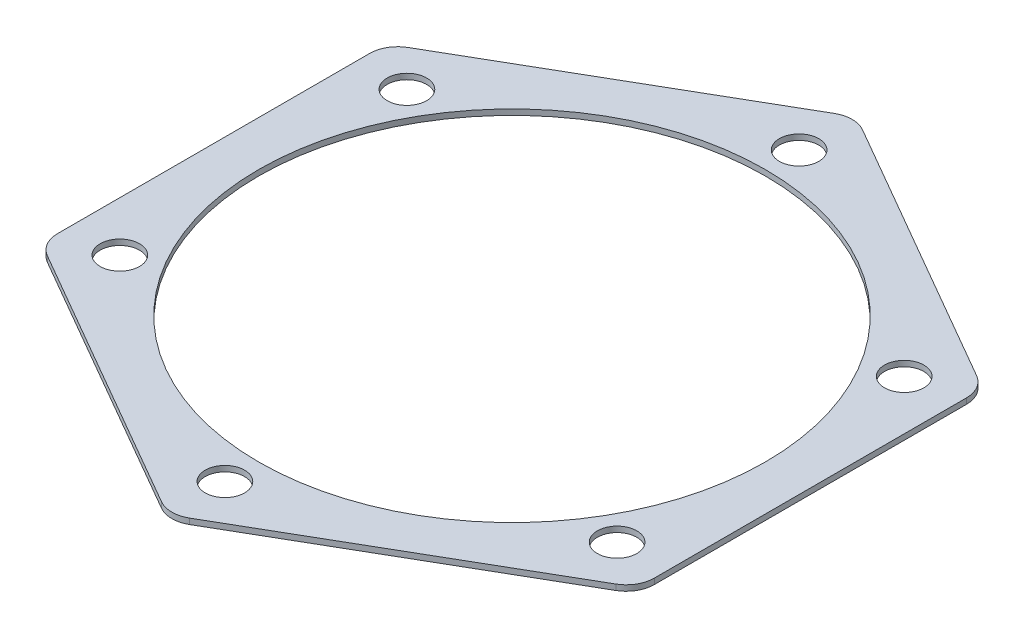
ISO-10303-21;
HEADER;
FILE_DESCRIPTION(('STEP AP214'),'2;1');
FILE_NAME('part.step','',(''),(''),'','','');
FILE_SCHEMA(('AUTOMOTIVE_DESIGN { 1 0 10303 214 1 1 1 1 }'));
ENDSEC;
DATA;
#1=APPLICATION_CONTEXT('core data for automotive mechanical design processes');
#2=APPLICATION_PROTOCOL_DEFINITION('international standard','automotive_design',2000,#1);
#3=PRODUCT_CONTEXT('',#1,'mechanical');
#4=PRODUCT('Part','Part','',(#3));
#5=PRODUCT_RELATED_PRODUCT_CATEGORY('part','',(#4));
#6=PRODUCT_DEFINITION_FORMATION('','',#4);
#7=PRODUCT_DEFINITION_CONTEXT('part definition',#1,'design');
#8=PRODUCT_DEFINITION('design','',#6,#7);
#9=PRODUCT_DEFINITION_SHAPE('','',#8);
#10=(LENGTH_UNIT() NAMED_UNIT(*) SI_UNIT(.MILLI.,.METRE.));
#11=(NAMED_UNIT(*) PLANE_ANGLE_UNIT() SI_UNIT($,.RADIAN.));
#12=(NAMED_UNIT(*) SI_UNIT($,.STERADIAN.) SOLID_ANGLE_UNIT());
#13=UNCERTAINTY_MEASURE_WITH_UNIT(LENGTH_MEASURE(1.E-05),#10,'distance_accuracy_value','');
#14=(GEOMETRIC_REPRESENTATION_CONTEXT(3) GLOBAL_UNCERTAINTY_ASSIGNED_CONTEXT((#13)) GLOBAL_UNIT_ASSIGNED_CONTEXT((#10,
#11,#12)) REPRESENTATION_CONTEXT('',''));
#15=CARTESIAN_POINT('',(0.,0.,0.));
#16=DIRECTION('',(0.,0.,1.));
#17=DIRECTION('',(1.,0.,0.));
#18=AXIS2_PLACEMENT_3D('',#15,#16,#17);
#19=CARTESIAN_POINT('',(-47.9999999999999,1.,27.7128129211023));
#20=DIRECTION('',(0.,1.,0.));
#21=DIRECTION('',(0.,0.,1.));
#22=AXIS2_PLACEMENT_3D('',#19,#20,#21);
#23=PLANE('',#22);
#24=CARTESIAN_POINT('',(-44.167295593002,1.,25.5000000000025));
#25=DIRECTION('',(0.,1.,0.));
#26=DIRECTION('',(0.,0.,1.));
#27=AXIS2_PLACEMENT_3D('',#24,#25,#26);
#28=CIRCLE('',#27,3.50000000000536);
#29=CARTESIAN_POINT('',(-44.167295593002,1.,29.0000000000079));
#30=VERTEX_POINT('',#29);
#31=EDGE_CURVE('E303',#30,#30,#28,.T.);
#32=ORIENTED_EDGE('',*,*,#31,.F.);
#33=EDGE_LOOP('',(#32));
#34=FACE_BOUND('',#33,.T.);
#35=CARTESIAN_POINT('',(44.1672955930107,1.,25.4999999999975));
#36=DIRECTION('',(0.,1.,0.));
#37=DIRECTION('',(0.,0.,1.));
#38=AXIS2_PLACEMENT_3D('',#35,#36,#37);
#39=CIRCLE('',#38,3.50000000000365);
#40=CARTESIAN_POINT('',(44.1672955930107,1.,29.0000000000011));
#41=VERTEX_POINT('',#40);
#42=EDGE_CURVE('E315',#41,#41,#39,.T.);
#43=ORIENTED_EDGE('',*,*,#42,.F.);
#44=EDGE_LOOP('',(#43));
#45=FACE_BOUND('',#44,.T.);
#46=CARTESIAN_POINT('',(0.,1.,-51.));
#47=DIRECTION('',(0.,1.,0.));
#48=DIRECTION('',(0.,0.,1.));
#49=AXIS2_PLACEMENT_3D('',#46,#47,#48);
#50=CIRCLE('',#49,3.5);
#51=CARTESIAN_POINT('',(0.,1.,-47.5));
#52=VERTEX_POINT('',#51);
#53=EDGE_CURVE('E327',#52,#52,#50,.T.);
#54=ORIENTED_EDGE('',*,*,#53,.F.);
#55=EDGE_LOOP('',(#54));
#56=FACE_BOUND('',#55,.T.);
#57=CARTESIAN_POINT('',(-47.9999999999999,1.,27.7128129211023));
#58=DIRECTION('',(0.,1.,0.));
#59=DIRECTION('',(0.,0.,1.));
#60=AXIS2_PLACEMENT_3D('',#57,#58,#59);
#61=CIRCLE('',#60,5.);
#62=CARTESIAN_POINT('',(-52.9999999999999,1.,27.7128129211023));
#63=VERTEX_POINT('',#62);
#64=CARTESIAN_POINT('',(-50.4999999999999,1.,32.0429399400245));
#65=VERTEX_POINT('',#64);
#66=EDGE_CURVE('E177',#63,#65,#61,.T.);
#67=ORIENTED_EDGE('',*,*,#66,.T.);
#68=DIRECTION('',(0.866025403784441,0.,0.499999999999995));
#69=VECTOR('',#68,1.);
#70=CARTESIAN_POINT('',(-50.4999999999999,1.,32.0429399400245));
#71=LINE('',#70,#69);
#72=CARTESIAN_POINT('',(-2.49999999999961,1.,59.7557528611263));
#73=VERTEX_POINT('',#72);
#74=EDGE_CURVE('E105',#65,#73,#71,.T.);
#75=ORIENTED_EDGE('',*,*,#74,.T.);
#76=CARTESIAN_POINT('',(3.87610001608621E-13,1.,55.4256258422041));
#77=DIRECTION('',(0.,1.,0.));
#78=DIRECTION('',(0.,0.,1.));
#79=AXIS2_PLACEMENT_3D('',#76,#77,#78);
#80=CIRCLE('',#79,5.);
#81=CARTESIAN_POINT('',(2.50000000000044,1.,59.7557528611263));
#82=VERTEX_POINT('',#81);
#83=EDGE_CURVE('E204',#73,#82,#80,.T.);
#84=ORIENTED_EDGE('',*,*,#83,.T.);
#85=DIRECTION('',(0.866025403784435,0.,-0.500000000000007));
#86=VECTOR('',#85,1.);
#87=CARTESIAN_POINT('',(2.50000000000044,1.,59.7557528611263));
#88=LINE('',#87,#86);
#89=CARTESIAN_POINT('',(50.5000000000003,1.,32.0429399400238));
#90=VERTEX_POINT('',#89);
#91=EDGE_CURVE('E223',#82,#90,#88,.T.);
#92=ORIENTED_EDGE('',*,*,#91,.T.);
#93=CARTESIAN_POINT('',(48.0000000000003,1.,27.7128129211016));
#94=DIRECTION('',(0.,1.,0.));
#95=DIRECTION('',(0.,0.,1.));
#96=AXIS2_PLACEMENT_3D('',#93,#94,#95);
#97=CIRCLE('',#96,5.);
#98=CARTESIAN_POINT('',(53.0000000000003,1.,27.7128129211015));
#99=VERTEX_POINT('',#98);
#100=EDGE_CURVE('E220',#90,#99,#97,.T.);
#101=ORIENTED_EDGE('',*,*,#100,.T.);
#102=DIRECTION('',(0.,0.,-1.));
#103=VECTOR('',#102,1.);
#104=CARTESIAN_POINT('',(53.0000000000003,1.,27.7128129211015));
#105=LINE('',#104,#103);
#106=CARTESIAN_POINT('',(52.9999999999997,1.,-27.7128129211027));
#107=VERTEX_POINT('',#106);
#108=EDGE_CURVE('E222',#99,#107,#105,.T.);
#109=ORIENTED_EDGE('',*,*,#108,.T.);
#110=CARTESIAN_POINT('',(47.9999999999997,1.,-27.7128129211026));
#111=DIRECTION('',(0.,1.,0.));
#112=DIRECTION('',(0.,0.,1.));
#113=AXIS2_PLACEMENT_3D('',#110,#111,#112);
#114=CIRCLE('',#113,5.);
#115=CARTESIAN_POINT('',(50.4999999999997,1.,-32.0429399400249));
#116=VERTEX_POINT('',#115);
#117=EDGE_CURVE('E225',#107,#116,#114,.T.);
#118=ORIENTED_EDGE('',*,*,#117,.T.);
#119=DIRECTION('',(-0.866025403784442,0.,-0.499999999999995));
#120=VECTOR('',#119,1.);
#121=CARTESIAN_POINT('',(50.4999999999997,1.,-32.0429399400249));
#122=LINE('',#121,#120);
#123=CARTESIAN_POINT('',(2.50000000000002,1.,-59.7557528611263));
#124=VERTEX_POINT('',#123);
#125=EDGE_CURVE('E231',#116,#124,#122,.T.);
#126=ORIENTED_EDGE('',*,*,#125,.T.);
#127=CARTESIAN_POINT('',(0.,1.,-55.4256258422041));
#128=DIRECTION('',(0.,1.,0.));
#129=DIRECTION('',(0.,0.,-1.));
#130=AXIS2_PLACEMENT_3D('',#127,#128,#129);
#131=CIRCLE('',#130,5.);
#132=CARTESIAN_POINT('',(-2.5,1.,-59.7557528611263));
#133=VERTEX_POINT('',#132);
#134=EDGE_CURVE('E136',#124,#133,#131,.T.);
#135=ORIENTED_EDGE('',*,*,#134,.T.);
#136=DIRECTION('',(-0.866025403784438,0.,0.500000000000001));
#137=VECTOR('',#136,1.);
#138=CARTESIAN_POINT('',(-2.5,1.,-59.7557528611263));
#139=LINE('',#138,#137);
#140=CARTESIAN_POINT('',(-50.5000000000001,1.,-32.0429399400241));
#141=VERTEX_POINT('',#140);
#142=EDGE_CURVE('E130',#133,#141,#139,.T.);
#143=ORIENTED_EDGE('',*,*,#142,.T.);
#144=CARTESIAN_POINT('',(-48.0000000000001,1.,-27.7128129211019));
#145=DIRECTION('',(0.,1.,0.));
#146=DIRECTION('',(0.,0.,1.));
#147=AXIS2_PLACEMENT_3D('',#144,#145,#146);
#148=CIRCLE('',#147,5.);
#149=CARTESIAN_POINT('',(-53.0000000000001,1.,-27.7128129211019));
#150=VERTEX_POINT('',#149);
#151=EDGE_CURVE('E134',#141,#150,#148,.T.);
#152=ORIENTED_EDGE('',*,*,#151,.T.);
#153=DIRECTION('',(0.,0.,1.));
#154=VECTOR('',#153,1.);
#155=CARTESIAN_POINT('',(-53.0000000000001,1.,-27.7128129211019));
#156=LINE('',#155,#154);
#157=EDGE_CURVE('E50',#150,#63,#156,.T.);
#158=ORIENTED_EDGE('',*,*,#157,.T.);
#159=EDGE_LOOP('',(#67,#75,#84,#92,#101,#109,#118,#126,#135,#143,#152,#158));
#160=FACE_BOUND('',#159,.T.);
#161=CARTESIAN_POINT('',(0.,1.,0.));
#162=DIRECTION('',(0.,1.,0.));
#163=DIRECTION('',(0.,0.,1.));
#164=AXIS2_PLACEMENT_3D('',#161,#162,#163);
#165=CIRCLE('',#164,45.);
#166=CARTESIAN_POINT('',(0.,1.,45.));
#167=VERTEX_POINT('',#166);
#168=EDGE_CURVE('E158',#167,#167,#165,.T.);
#169=ORIENTED_EDGE('',*,*,#168,.F.);
#170=EDGE_LOOP('',(#169));
#171=FACE_BOUND('',#170,.T.);
#172=CARTESIAN_POINT('',(44.1672955930078,1.,-25.5000000000025));
#173=DIRECTION('',(0.,1.,0.));
#174=DIRECTION('',(0.,0.,1.));
#175=AXIS2_PLACEMENT_3D('',#172,#173,#174);
#176=CIRCLE('',#175,3.50000000000079);
#177=CARTESIAN_POINT('',(44.1672955930078,1.,-22.0000000000017));
#178=VERTEX_POINT('',#177);
#179=EDGE_CURVE('E321',#178,#178,#176,.T.);
#180=ORIENTED_EDGE('',*,*,#179,.F.);
#181=EDGE_LOOP('',(#180));
#182=FACE_BOUND('',#181,.T.);
#183=CARTESIAN_POINT('',(5.77929162777546E-12,1.,51.));
#184=DIRECTION('',(0.,1.,0.));
#185=DIRECTION('',(0.,0.,1.));
#186=AXIS2_PLACEMENT_3D('',#183,#184,#185);
#187=CIRCLE('',#186,3.50000000000587);
#188=CARTESIAN_POINT('',(5.77929162777546E-12,1.,54.5000000000059));
#189=VERTEX_POINT('',#188);
#190=EDGE_CURVE('E309',#189,#189,#187,.T.);
#191=ORIENTED_EDGE('',*,*,#190,.F.);
#192=EDGE_LOOP('',(#191));
#193=FACE_BOUND('',#192,.T.);
#194=CARTESIAN_POINT('',(-44.1672955930049,1.,-25.4999999999975));
#195=DIRECTION('',(0.,1.,0.));
#196=DIRECTION('',(0.,0.,1.));
#197=AXIS2_PLACEMENT_3D('',#194,#195,#196);
#198=CIRCLE('',#197,3.50000000000272);
#199=CARTESIAN_POINT('',(-44.1672955930049,1.,-21.9999999999947));
#200=VERTEX_POINT('',#199);
#201=EDGE_CURVE('E294',#200,#200,#198,.T.);
#202=ORIENTED_EDGE('',*,*,#201,.F.);
#203=EDGE_LOOP('',(#202));
#204=FACE_BOUND('',#203,.T.);
#205=ADVANCED_FACE('F33',(#34,#45,#56,#160,#171,#182,#193,#204),#23,.T.);
#206=CARTESIAN_POINT('',(-47.9999999999999,0.,27.7128129211023));
#207=DIRECTION('',(0.,1.,0.));
#208=DIRECTION('',(0.,0.,1.));
#209=AXIS2_PLACEMENT_3D('',#206,#207,#208);
#210=PLANE('',#209);
#211=CARTESIAN_POINT('',(-47.9999999999999,0.,27.7128129211023));
#212=DIRECTION('',(0.,1.,0.));
#213=DIRECTION('',(0.,0.,1.));
#214=AXIS2_PLACEMENT_3D('',#211,#212,#213);
#215=CIRCLE('',#214,5.);
#216=CARTESIAN_POINT('',(-52.9999999999999,0.,27.7128129211023));
#217=VERTEX_POINT('',#216);
#218=CARTESIAN_POINT('',(-50.4999999999999,0.,32.0429399400245));
#219=VERTEX_POINT('',#218);
#220=EDGE_CURVE('E154',#217,#219,#215,.T.);
#221=ORIENTED_EDGE('',*,*,#220,.F.);
#222=DIRECTION('',(0.,0.,1.));
#223=VECTOR('',#222,1.);
#224=CARTESIAN_POINT('',(-53.0000000000001,0.,-27.7128129211019));
#225=LINE('',#224,#223);
#226=CARTESIAN_POINT('',(-53.0000000000001,0.,-27.7128129211019));
#227=VERTEX_POINT('',#226);
#228=EDGE_CURVE('E97',#227,#217,#225,.T.);
#229=ORIENTED_EDGE('',*,*,#228,.F.);
#230=CARTESIAN_POINT('',(-48.0000000000001,0.,-27.7128129211019));
#231=DIRECTION('',(0.,1.,0.));
#232=DIRECTION('',(0.,0.,1.));
#233=AXIS2_PLACEMENT_3D('',#230,#231,#232);
#234=CIRCLE('',#233,5.);
#235=CARTESIAN_POINT('',(-50.5000000000001,0.,-32.0429399400241));
#236=VERTEX_POINT('',#235);
#237=EDGE_CURVE('E91',#236,#227,#234,.T.);
#238=ORIENTED_EDGE('',*,*,#237,.F.);
#239=DIRECTION('',(-0.866025403784438,0.,0.500000000000001));
#240=VECTOR('',#239,1.);
#241=CARTESIAN_POINT('',(-2.5,0.,-59.7557528611263));
#242=LINE('',#241,#240);
#243=CARTESIAN_POINT('',(-2.5,0.,-59.7557528611263));
#244=VERTEX_POINT('',#243);
#245=EDGE_CURVE('E144',#244,#236,#242,.T.);
#246=ORIENTED_EDGE('',*,*,#245,.F.);
#247=CARTESIAN_POINT('',(0.,0.,-55.4256258422041));
#248=DIRECTION('',(0.,1.,0.));
#249=DIRECTION('',(0.,0.,-1.));
#250=AXIS2_PLACEMENT_3D('',#247,#248,#249);
#251=CIRCLE('',#250,5.);
#252=CARTESIAN_POINT('',(2.50000000000002,0.,-59.7557528611263));
#253=VERTEX_POINT('',#252);
#254=EDGE_CURVE('E172',#253,#244,#251,.T.);
#255=ORIENTED_EDGE('',*,*,#254,.F.);
#256=DIRECTION('',(-0.866025403784442,0.,-0.499999999999995));
#257=VECTOR('',#256,1.);
#258=CARTESIAN_POINT('',(50.4999999999997,0.,-32.0429399400249));
#259=LINE('',#258,#257);
#260=CARTESIAN_POINT('',(50.4999999999997,0.,-32.0429399400249));
#261=VERTEX_POINT('',#260);
#262=EDGE_CURVE('E170',#261,#253,#259,.T.);
#263=ORIENTED_EDGE('',*,*,#262,.F.);
#264=CARTESIAN_POINT('',(47.9999999999997,0.,-27.7128129211026));
#265=DIRECTION('',(0.,1.,0.));
#266=DIRECTION('',(0.,0.,1.));
#267=AXIS2_PLACEMENT_3D('',#264,#265,#266);
#268=CIRCLE('',#267,5.);
#269=CARTESIAN_POINT('',(52.9999999999997,0.,-27.7128129211027));
#270=VERTEX_POINT('',#269);
#271=EDGE_CURVE('E168',#270,#261,#268,.T.);
#272=ORIENTED_EDGE('',*,*,#271,.F.);
#273=DIRECTION('',(0.,0.,-1.));
#274=VECTOR('',#273,1.);
#275=CARTESIAN_POINT('',(53.0000000000003,0.,27.7128129211015));
#276=LINE('',#275,#274);
#277=CARTESIAN_POINT('',(53.0000000000003,0.,27.7128129211015));
#278=VERTEX_POINT('',#277);
#279=EDGE_CURVE('E166',#278,#270,#276,.T.);
#280=ORIENTED_EDGE('',*,*,#279,.F.);
#281=CARTESIAN_POINT('',(48.0000000000003,0.,27.7128129211016));
#282=DIRECTION('',(0.,1.,0.));
#283=DIRECTION('',(0.,0.,1.));
#284=AXIS2_PLACEMENT_3D('',#281,#282,#283);
#285=CIRCLE('',#284,5.);
#286=CARTESIAN_POINT('',(50.5000000000003,0.,32.0429399400238));
#287=VERTEX_POINT('',#286);
#288=EDGE_CURVE('E164',#287,#278,#285,.T.);
#289=ORIENTED_EDGE('',*,*,#288,.F.);
#290=DIRECTION('',(0.866025403784435,0.,-0.500000000000007));
#291=VECTOR('',#290,1.);
#292=CARTESIAN_POINT('',(2.50000000000044,0.,59.7557528611263));
#293=LINE('',#292,#291);
#294=CARTESIAN_POINT('',(2.50000000000044,0.,59.7557528611263));
#295=VERTEX_POINT('',#294);
#296=EDGE_CURVE('E162',#295,#287,#293,.T.);
#297=ORIENTED_EDGE('',*,*,#296,.F.);
#298=CARTESIAN_POINT('',(3.87610001608621E-13,0.,55.4256258422041));
#299=DIRECTION('',(0.,1.,0.));
#300=DIRECTION('',(0.,0.,1.));
#301=AXIS2_PLACEMENT_3D('',#298,#299,#300);
#302=CIRCLE('',#301,5.);
#303=CARTESIAN_POINT('',(-2.49999999999961,0.,59.7557528611263));
#304=VERTEX_POINT('',#303);
#305=EDGE_CURVE('E160',#304,#295,#302,.T.);
#306=ORIENTED_EDGE('',*,*,#305,.F.);
#307=DIRECTION('',(0.866025403784441,0.,0.499999999999995));
#308=VECTOR('',#307,1.);
#309=CARTESIAN_POINT('',(-50.4999999999999,0.,32.0429399400245));
#310=LINE('',#309,#308);
#311=EDGE_CURVE('E157',#219,#304,#310,.T.);
#312=ORIENTED_EDGE('',*,*,#311,.F.);
#313=EDGE_LOOP('',(#221,#229,#238,#246,#255,#263,#272,#280,#289,#297,#306,#312));
#314=FACE_BOUND('',#313,.T.);
#315=CARTESIAN_POINT('',(0.,0.,0.));
#316=DIRECTION('',(0.,1.,0.));
#317=DIRECTION('',(0.,0.,1.));
#318=AXIS2_PLACEMENT_3D('',#315,#316,#317);
#319=CIRCLE('',#318,45.);
#320=CARTESIAN_POINT('',(0.,0.,45.));
#321=VERTEX_POINT('',#320);
#322=EDGE_CURVE('E330',#321,#321,#319,.T.);
#323=ORIENTED_EDGE('',*,*,#322,.T.);
#324=EDGE_LOOP('',(#323));
#325=FACE_BOUND('',#324,.T.);
#326=CARTESIAN_POINT('',(0.,0.,-51.));
#327=DIRECTION('',(0.,1.,0.));
#328=DIRECTION('',(0.,0.,1.));
#329=AXIS2_PLACEMENT_3D('',#326,#327,#328);
#330=CIRCLE('',#329,3.5);
#331=CARTESIAN_POINT('',(0.,0.,-47.5));
#332=VERTEX_POINT('',#331);
#333=EDGE_CURVE('E324',#332,#332,#330,.T.);
#334=ORIENTED_EDGE('',*,*,#333,.T.);
#335=EDGE_LOOP('',(#334));
#336=FACE_BOUND('',#335,.T.);
#337=CARTESIAN_POINT('',(44.1672955930078,0.,-25.5000000000025));
#338=DIRECTION('',(0.,1.,0.));
#339=DIRECTION('',(0.,0.,1.));
#340=AXIS2_PLACEMENT_3D('',#337,#338,#339);
#341=CIRCLE('',#340,3.50000000000079);
#342=CARTESIAN_POINT('',(44.1672955930078,0.,-22.0000000000017));
#343=VERTEX_POINT('',#342);
#344=EDGE_CURVE('E318',#343,#343,#341,.T.);
#345=ORIENTED_EDGE('',*,*,#344,.T.);
#346=EDGE_LOOP('',(#345));
#347=FACE_BOUND('',#346,.T.);
#348=CARTESIAN_POINT('',(44.1672955930107,0.,25.4999999999975));
#349=DIRECTION('',(0.,1.,0.));
#350=DIRECTION('',(0.,0.,1.));
#351=AXIS2_PLACEMENT_3D('',#348,#349,#350);
#352=CIRCLE('',#351,3.50000000000365);
#353=CARTESIAN_POINT('',(44.1672955930107,0.,29.0000000000011));
#354=VERTEX_POINT('',#353);
#355=EDGE_CURVE('E312',#354,#354,#352,.T.);
#356=ORIENTED_EDGE('',*,*,#355,.T.);
#357=EDGE_LOOP('',(#356));
#358=FACE_BOUND('',#357,.T.);
#359=CARTESIAN_POINT('',(5.77929162777546E-12,0.,51.));
#360=DIRECTION('',(0.,1.,0.));
#361=DIRECTION('',(0.,0.,1.));
#362=AXIS2_PLACEMENT_3D('',#359,#360,#361);
#363=CIRCLE('',#362,3.50000000000587);
#364=CARTESIAN_POINT('',(5.77929162777546E-12,0.,54.5000000000059));
#365=VERTEX_POINT('',#364);
#366=EDGE_CURVE('E306',#365,#365,#363,.T.);
#367=ORIENTED_EDGE('',*,*,#366,.T.);
#368=EDGE_LOOP('',(#367));
#369=FACE_BOUND('',#368,.T.);
#370=CARTESIAN_POINT('',(-44.167295593002,0.,25.5000000000025));
#371=DIRECTION('',(0.,1.,0.));
#372=DIRECTION('',(0.,0.,1.));
#373=AXIS2_PLACEMENT_3D('',#370,#371,#372);
#374=CIRCLE('',#373,3.50000000000536);
#375=CARTESIAN_POINT('',(-44.167295593002,0.,29.0000000000079));
#376=VERTEX_POINT('',#375);
#377=EDGE_CURVE('E300',#376,#376,#374,.T.);
#378=ORIENTED_EDGE('',*,*,#377,.T.);
#379=EDGE_LOOP('',(#378));
#380=FACE_BOUND('',#379,.T.);
#381=CARTESIAN_POINT('',(-44.1672955930049,0.,-25.4999999999975));
#382=DIRECTION('',(0.,1.,0.));
#383=DIRECTION('',(0.,0.,1.));
#384=AXIS2_PLACEMENT_3D('',#381,#382,#383);
#385=CIRCLE('',#384,3.50000000000272);
#386=CARTESIAN_POINT('',(-44.1672955930049,0.,-21.9999999999947));
#387=VERTEX_POINT('',#386);
#388=EDGE_CURVE('E297',#387,#387,#385,.T.);
#389=ORIENTED_EDGE('',*,*,#388,.T.);
#390=EDGE_LOOP('',(#389));
#391=FACE_BOUND('',#390,.T.);
#392=ADVANCED_FACE('F208',(#314,#325,#336,#347,#358,#369,#380,#391),#210,.F.);
#393=CARTESIAN_POINT('',(-47.9999999999999,1.,27.7128129211023));
#394=DIRECTION('',(0.,-1.,0.));
#395=DIRECTION('',(0.,0.,-1.));
#396=AXIS2_PLACEMENT_3D('',#393,#394,#395);
#397=CYLINDRICAL_SURFACE('',#396,5.);
#398=ORIENTED_EDGE('',*,*,#220,.T.);
#399=DIRECTION('',(0.,-1.,0.));
#400=VECTOR('',#399,1.);
#401=CARTESIAN_POINT('',(-50.4999999999999,1.,32.0429399400245));
#402=LINE('',#401,#400);
#403=EDGE_CURVE('E11',#65,#219,#402,.T.);
#404=ORIENTED_EDGE('',*,*,#403,.F.);
#405=ORIENTED_EDGE('',*,*,#66,.F.);
#406=DIRECTION('',(0.,-1.,0.));
#407=VECTOR('',#406,1.);
#408=CARTESIAN_POINT('',(-52.9999999999999,1.,27.7128129211023));
#409=LINE('',#408,#407);
#410=EDGE_CURVE('E150',#63,#217,#409,.T.);
#411=ORIENTED_EDGE('',*,*,#410,.T.);
#412=EDGE_LOOP('',(#398,#404,#405,#411));
#413=FACE_BOUND('',#412,.T.);
#414=ADVANCED_FACE('F35',(#413),#397,.T.);
#415=CARTESIAN_POINT('',(-50.4999999999999,1.,32.0429399400245));
#416=DIRECTION('',(0.499999999999995,0.,-0.866025403784441));
#417=DIRECTION('',(-0.866025403784442,0.,-0.499999999999995));
#418=AXIS2_PLACEMENT_3D('',#415,#416,#417);
#419=PLANE('',#418);
#420=ORIENTED_EDGE('',*,*,#311,.T.);
#421=DIRECTION('',(0.,-1.,0.));
#422=VECTOR('',#421,1.);
#423=CARTESIAN_POINT('',(-2.49999999999961,1.,59.7557528611263));
#424=LINE('',#423,#422);
#425=EDGE_CURVE('E42',#73,#304,#424,.T.);
#426=ORIENTED_EDGE('',*,*,#425,.F.);
#427=ORIENTED_EDGE('',*,*,#74,.F.);
#428=ORIENTED_EDGE('',*,*,#403,.T.);
#429=EDGE_LOOP('',(#420,#426,#427,#428));
#430=FACE_BOUND('',#429,.T.);
#431=ADVANCED_FACE('F467',(#430),#419,.F.);
#432=CARTESIAN_POINT('',(3.87610001608621E-13,1.,55.4256258422041));
#433=DIRECTION('',(0.,-1.,0.));
#434=DIRECTION('',(0.,0.,-1.));
#435=AXIS2_PLACEMENT_3D('',#432,#433,#434);
#436=CYLINDRICAL_SURFACE('',#435,5.);
#437=ORIENTED_EDGE('',*,*,#305,.T.);
#438=DIRECTION('',(0.,-1.,0.));
#439=VECTOR('',#438,1.);
#440=CARTESIAN_POINT('',(2.50000000000044,1.,59.7557528611263));
#441=LINE('',#440,#439);
#442=EDGE_CURVE('E196',#82,#295,#441,.T.);
#443=ORIENTED_EDGE('',*,*,#442,.F.);
#444=ORIENTED_EDGE('',*,*,#83,.F.);
#445=ORIENTED_EDGE('',*,*,#425,.T.);
#446=EDGE_LOOP('',(#437,#443,#444,#445));
#447=FACE_BOUND('',#446,.T.);
#448=ADVANCED_FACE('F202',(#447),#436,.T.);
#449=CARTESIAN_POINT('',(2.50000000000044,1.,59.7557528611263));
#450=DIRECTION('',(-0.500000000000007,0.,-0.866025403784435));
#451=DIRECTION('',(-0.866025403784434,0.,0.500000000000007));
#452=AXIS2_PLACEMENT_3D('',#449,#450,#451);
#453=PLANE('',#452);
#454=ORIENTED_EDGE('',*,*,#296,.T.);
#455=DIRECTION('',(0.,-1.,0.));
#456=VECTOR('',#455,1.);
#457=CARTESIAN_POINT('',(50.5000000000003,1.,32.0429399400238));
#458=LINE('',#457,#456);
#459=EDGE_CURVE('E193',#90,#287,#458,.T.);
#460=ORIENTED_EDGE('',*,*,#459,.F.);
#461=ORIENTED_EDGE('',*,*,#91,.F.);
#462=ORIENTED_EDGE('',*,*,#442,.T.);
#463=EDGE_LOOP('',(#454,#460,#461,#462));
#464=FACE_BOUND('',#463,.T.);
#465=ADVANCED_FACE('F214',(#464),#453,.F.);
#466=CARTESIAN_POINT('',(48.0000000000003,1.,27.7128129211016));
#467=DIRECTION('',(0.,-1.,0.));
#468=DIRECTION('',(0.,0.,-1.));
#469=AXIS2_PLACEMENT_3D('',#466,#467,#468);
#470=CYLINDRICAL_SURFACE('',#469,5.);
#471=ORIENTED_EDGE('',*,*,#288,.T.);
#472=DIRECTION('',(0.,-1.,0.));
#473=VECTOR('',#472,1.);
#474=CARTESIAN_POINT('',(53.0000000000003,1.,27.7128129211015));
#475=LINE('',#474,#473);
#476=EDGE_CURVE('E190',#99,#278,#475,.T.);
#477=ORIENTED_EDGE('',*,*,#476,.F.);
#478=ORIENTED_EDGE('',*,*,#100,.F.);
#479=ORIENTED_EDGE('',*,*,#459,.T.);
#480=EDGE_LOOP('',(#471,#477,#478,#479));
#481=FACE_BOUND('',#480,.T.);
#482=ADVANCED_FACE('F218',(#481),#470,.T.);
#483=CARTESIAN_POINT('',(53.0000000000003,1.,27.7128129211015));
#484=DIRECTION('',(-1.,0.,0.));
#485=DIRECTION('',(0.,0.,1.));
#486=AXIS2_PLACEMENT_3D('',#483,#484,#485);
#487=PLANE('',#486);
#488=ORIENTED_EDGE('',*,*,#279,.T.);
#489=DIRECTION('',(0.,-1.,0.));
#490=VECTOR('',#489,1.);
#491=CARTESIAN_POINT('',(52.9999999999997,1.,-27.7128129211027));
#492=LINE('',#491,#490);
#493=EDGE_CURVE('E187',#107,#270,#492,.T.);
#494=ORIENTED_EDGE('',*,*,#493,.F.);
#495=ORIENTED_EDGE('',*,*,#108,.F.);
#496=ORIENTED_EDGE('',*,*,#476,.T.);
#497=EDGE_LOOP('',(#488,#494,#495,#496));
#498=FACE_BOUND('',#497,.T.);
#499=ADVANCED_FACE('F432',(#498),#487,.F.);
#500=CARTESIAN_POINT('',(47.9999999999997,1.,-27.7128129211026));
#501=DIRECTION('',(0.,-1.,0.));
#502=DIRECTION('',(0.,0.,-1.));
#503=AXIS2_PLACEMENT_3D('',#500,#501,#502);
#504=CYLINDRICAL_SURFACE('',#503,5.);
#505=ORIENTED_EDGE('',*,*,#271,.T.);
#506=DIRECTION('',(0.,-1.,0.));
#507=VECTOR('',#506,1.);
#508=CARTESIAN_POINT('',(50.4999999999997,1.,-32.0429399400249));
#509=LINE('',#508,#507);
#510=EDGE_CURVE('E184',#116,#261,#509,.T.);
#511=ORIENTED_EDGE('',*,*,#510,.F.);
#512=ORIENTED_EDGE('',*,*,#117,.F.);
#513=ORIENTED_EDGE('',*,*,#493,.T.);
#514=EDGE_LOOP('',(#505,#511,#512,#513));
#515=FACE_BOUND('',#514,.T.);
#516=ADVANCED_FACE('F423',(#515),#504,.T.);
#517=CARTESIAN_POINT('',(50.4999999999997,1.,-32.0429399400249));
#518=DIRECTION('',(-0.499999999999995,0.,0.866025403784442));
#519=DIRECTION('',(0.866025403784442,0.,0.499999999999995));
#520=AXIS2_PLACEMENT_3D('',#517,#518,#519);
#521=PLANE('',#520);
#522=ORIENTED_EDGE('',*,*,#262,.T.);
#523=DIRECTION('',(0.,-1.,0.));
#524=VECTOR('',#523,1.);
#525=CARTESIAN_POINT('',(2.50000000000002,1.,-59.7557528611263));
#526=LINE('',#525,#524);
#527=EDGE_CURVE('E181',#124,#253,#526,.T.);
#528=ORIENTED_EDGE('',*,*,#527,.F.);
#529=ORIENTED_EDGE('',*,*,#125,.F.);
#530=ORIENTED_EDGE('',*,*,#510,.T.);
#531=EDGE_LOOP('',(#522,#528,#529,#530));
#532=FACE_BOUND('',#531,.T.);
#533=ADVANCED_FACE('F237',(#532),#521,.F.);
#534=CARTESIAN_POINT('',(0.,1.,-55.4256258422041));
#535=DIRECTION('',(0.,-1.,0.));
#536=DIRECTION('',(0.,0.,-1.));
#537=AXIS2_PLACEMENT_3D('',#534,#535,#536);
#538=CYLINDRICAL_SURFACE('',#537,5.);
#539=ORIENTED_EDGE('',*,*,#254,.T.);
#540=DIRECTION('',(0.,-1.,0.));
#541=VECTOR('',#540,1.);
#542=CARTESIAN_POINT('',(-2.5,1.,-59.7557528611263));
#543=LINE('',#542,#541);
#544=EDGE_CURVE('E145',#133,#244,#543,.T.);
#545=ORIENTED_EDGE('',*,*,#544,.F.);
#546=ORIENTED_EDGE('',*,*,#134,.F.);
#547=ORIENTED_EDGE('',*,*,#527,.T.);
#548=EDGE_LOOP('',(#539,#545,#546,#547));
#549=FACE_BOUND('',#548,.T.);
#550=ADVANCED_FACE('F241',(#549),#538,.T.);
#551=CARTESIAN_POINT('',(-2.5,1.,-59.7557528611263));
#552=DIRECTION('',(0.500000000000001,0.,0.866025403784438));
#553=DIRECTION('',(0.866025403784438,0.,-0.500000000000001));
#554=AXIS2_PLACEMENT_3D('',#551,#552,#553);
#555=PLANE('',#554);
#556=ORIENTED_EDGE('',*,*,#245,.T.);
#557=DIRECTION('',(0.,-1.,0.));
#558=VECTOR('',#557,1.);
#559=CARTESIAN_POINT('',(-50.5000000000001,1.,-32.0429399400241));
#560=LINE('',#559,#558);
#561=EDGE_CURVE('E141',#141,#236,#560,.T.);
#562=ORIENTED_EDGE('',*,*,#561,.F.);
#563=ORIENTED_EDGE('',*,*,#142,.F.);
#564=ORIENTED_EDGE('',*,*,#544,.T.);
#565=EDGE_LOOP('',(#556,#562,#563,#564));
#566=FACE_BOUND('',#565,.T.);
#567=ADVANCED_FACE('F142',(#566),#555,.F.);
#568=CARTESIAN_POINT('',(-48.0000000000001,1.,-27.7128129211019));
#569=DIRECTION('',(0.,-1.,0.));
#570=DIRECTION('',(0.,0.,-1.));
#571=AXIS2_PLACEMENT_3D('',#568,#569,#570);
#572=CYLINDRICAL_SURFACE('',#571,5.);
#573=ORIENTED_EDGE('',*,*,#237,.T.);
#574=DIRECTION('',(0.,-1.,0.));
#575=VECTOR('',#574,1.);
#576=CARTESIAN_POINT('',(-53.0000000000001,1.,-27.7128129211019));
#577=LINE('',#576,#575);
#578=EDGE_CURVE('E146',#150,#227,#577,.T.);
#579=ORIENTED_EDGE('',*,*,#578,.F.);
#580=ORIENTED_EDGE('',*,*,#151,.F.);
#581=ORIENTED_EDGE('',*,*,#561,.T.);
#582=EDGE_LOOP('',(#573,#579,#580,#581));
#583=FACE_BOUND('',#582,.T.);
#584=ADVANCED_FACE('F148',(#583),#572,.T.);
#585=CARTESIAN_POINT('',(-53.0000000000001,1.,-27.7128129211019));
#586=DIRECTION('',(1.,0.,0.));
#587=DIRECTION('',(0.,0.,-1.));
#588=AXIS2_PLACEMENT_3D('',#585,#586,#587);
#589=PLANE('',#588);
#590=ORIENTED_EDGE('',*,*,#228,.T.);
#591=ORIENTED_EDGE('',*,*,#410,.F.);
#592=ORIENTED_EDGE('',*,*,#157,.F.);
#593=ORIENTED_EDGE('',*,*,#578,.T.);
#594=EDGE_LOOP('',(#590,#591,#592,#593));
#595=FACE_BOUND('',#594,.T.);
#596=ADVANCED_FACE('F245',(#595),#589,.F.);
#597=CARTESIAN_POINT('',(0.,1.,0.));
#598=DIRECTION('',(0.,-1.,0.));
#599=DIRECTION('',(0.,0.,-1.));
#600=AXIS2_PLACEMENT_3D('',#597,#598,#599);
#601=CYLINDRICAL_SURFACE('',#600,45.);
#602=ORIENTED_EDGE('',*,*,#168,.T.);
#603=EDGE_LOOP('',(#602));
#604=FACE_BOUND('',#603,.T.);
#605=ORIENTED_EDGE('',*,*,#322,.F.);
#606=EDGE_LOOP('',(#605));
#607=FACE_BOUND('',#606,.T.);
#608=ADVANCED_FACE('F247',(#604,#607),#601,.F.);
#609=CARTESIAN_POINT('',(0.,1.,-51.));
#610=DIRECTION('',(0.,-1.,0.));
#611=DIRECTION('',(0.,0.,-1.));
#612=AXIS2_PLACEMENT_3D('',#609,#610,#611);
#613=CYLINDRICAL_SURFACE('',#612,3.5);
#614=ORIENTED_EDGE('',*,*,#53,.T.);
#615=EDGE_LOOP('',(#614));
#616=FACE_BOUND('',#615,.T.);
#617=ORIENTED_EDGE('',*,*,#333,.F.);
#618=EDGE_LOOP('',(#617));
#619=FACE_BOUND('',#618,.T.);
#620=ADVANCED_FACE('F253',(#616,#619),#613,.F.);
#621=CARTESIAN_POINT('',(44.1672955930078,1.,-25.5000000000025));
#622=DIRECTION('',(0.,-1.,0.));
#623=DIRECTION('',(0.,0.,-1.));
#624=AXIS2_PLACEMENT_3D('',#621,#622,#623);
#625=CYLINDRICAL_SURFACE('',#624,3.50000000000079);
#626=ORIENTED_EDGE('',*,*,#179,.T.);
#627=EDGE_LOOP('',(#626));
#628=FACE_BOUND('',#627,.T.);
#629=ORIENTED_EDGE('',*,*,#344,.F.);
#630=EDGE_LOOP('',(#629));
#631=FACE_BOUND('',#630,.T.);
#632=ADVANCED_FACE('F269',(#628,#631),#625,.F.);
#633=CARTESIAN_POINT('',(44.1672955930107,1.,25.4999999999975));
#634=DIRECTION('',(0.,-1.,0.));
#635=DIRECTION('',(0.,0.,-1.));
#636=AXIS2_PLACEMENT_3D('',#633,#634,#635);
#637=CYLINDRICAL_SURFACE('',#636,3.50000000000365);
#638=ORIENTED_EDGE('',*,*,#42,.T.);
#639=EDGE_LOOP('',(#638));
#640=FACE_BOUND('',#639,.T.);
#641=ORIENTED_EDGE('',*,*,#355,.F.);
#642=EDGE_LOOP('',(#641));
#643=FACE_BOUND('',#642,.T.);
#644=ADVANCED_FACE('F273',(#640,#643),#637,.F.);
#645=CARTESIAN_POINT('',(5.77929162777546E-12,1.,51.));
#646=DIRECTION('',(0.,-1.,0.));
#647=DIRECTION('',(0.,0.,-1.));
#648=AXIS2_PLACEMENT_3D('',#645,#646,#647);
#649=CYLINDRICAL_SURFACE('',#648,3.50000000000587);
#650=ORIENTED_EDGE('',*,*,#190,.T.);
#651=EDGE_LOOP('',(#650));
#652=FACE_BOUND('',#651,.T.);
#653=ORIENTED_EDGE('',*,*,#366,.F.);
#654=EDGE_LOOP('',(#653));
#655=FACE_BOUND('',#654,.T.);
#656=ADVANCED_FACE('F277',(#652,#655),#649,.F.);
#657=CARTESIAN_POINT('',(-44.167295593002,1.,25.5000000000025));
#658=DIRECTION('',(0.,-1.,0.));
#659=DIRECTION('',(0.,0.,-1.));
#660=AXIS2_PLACEMENT_3D('',#657,#658,#659);
#661=CYLINDRICAL_SURFACE('',#660,3.50000000000536);
#662=ORIENTED_EDGE('',*,*,#31,.T.);
#663=EDGE_LOOP('',(#662));
#664=FACE_BOUND('',#663,.T.);
#665=ORIENTED_EDGE('',*,*,#377,.F.);
#666=EDGE_LOOP('',(#665));
#667=FACE_BOUND('',#666,.T.);
#668=ADVANCED_FACE('F281',(#664,#667),#661,.F.);
#669=CARTESIAN_POINT('',(-44.1672955930049,1.,-25.4999999999975));
#670=DIRECTION('',(0.,-1.,0.));
#671=DIRECTION('',(0.,0.,-1.));
#672=AXIS2_PLACEMENT_3D('',#669,#670,#671);
#673=CYLINDRICAL_SURFACE('',#672,3.50000000000272);
#674=ORIENTED_EDGE('',*,*,#201,.T.);
#675=EDGE_LOOP('',(#674));
#676=FACE_BOUND('',#675,.T.);
#677=ORIENTED_EDGE('',*,*,#388,.F.);
#678=EDGE_LOOP('',(#677));
#679=FACE_BOUND('',#678,.T.);
#680=ADVANCED_FACE('F285',(#676,#679),#673,.F.);
#681=CLOSED_SHELL('',(#205,#392,#414,#431,#448,#465,#482,#499,#516,#533,#550,#567,#584,#596,
#608,#620,#632,#644,#656,#668,#680));
#682=MANIFOLD_SOLID_BREP('B2',#681);
#683=ADVANCED_BREP_SHAPE_REPRESENTATION('',(#18,#682),#14);
#684=SHAPE_DEFINITION_REPRESENTATION(#9,#683);
ENDSEC;
END-ISO-10303-21;
